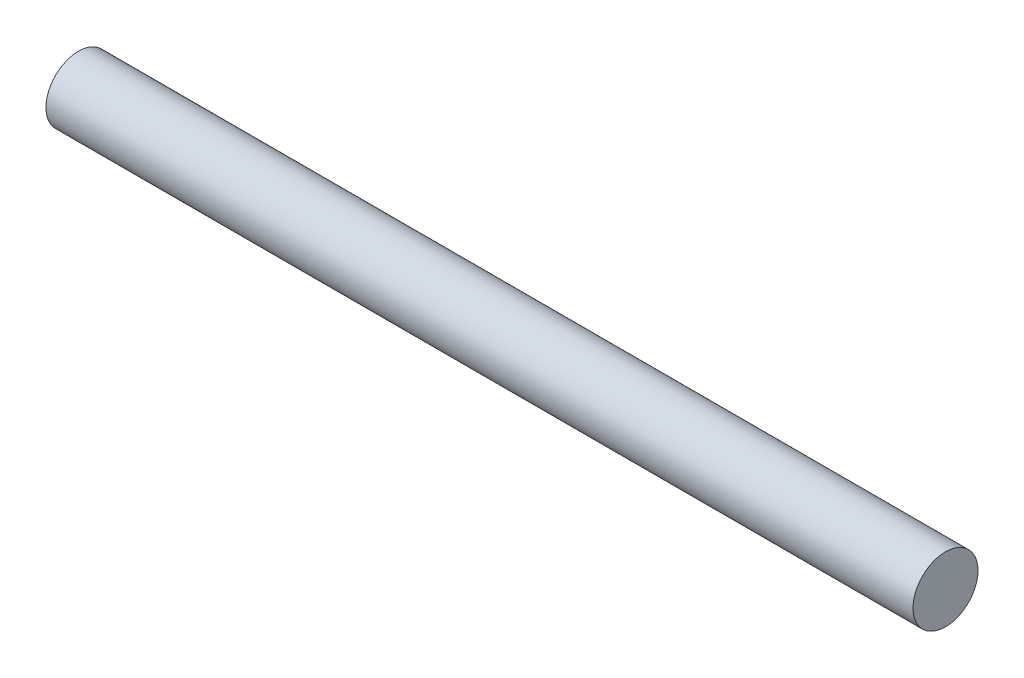
ISO-10303-21;
HEADER;
FILE_DESCRIPTION(('STEP AP214'),'2;1');
FILE_NAME('part.step','',(''),(''),'','','');
FILE_SCHEMA(('AUTOMOTIVE_DESIGN { 1 0 10303 214 1 1 1 1 }'));
ENDSEC;
DATA;
#1=APPLICATION_CONTEXT('core data for automotive mechanical design processes');
#2=APPLICATION_PROTOCOL_DEFINITION('international standard','automotive_design',2000,#1);
#3=PRODUCT_CONTEXT('',#1,'mechanical');
#4=PRODUCT('Part','Part','',(#3));
#5=PRODUCT_RELATED_PRODUCT_CATEGORY('part','',(#4));
#6=PRODUCT_DEFINITION_FORMATION('','',#4);
#7=PRODUCT_DEFINITION_CONTEXT('part definition',#1,'design');
#8=PRODUCT_DEFINITION('design','',#6,#7);
#9=PRODUCT_DEFINITION_SHAPE('','',#8);
#10=(LENGTH_UNIT() NAMED_UNIT(*) SI_UNIT(.MILLI.,.METRE.));
#11=(NAMED_UNIT(*) PLANE_ANGLE_UNIT() SI_UNIT($,.RADIAN.));
#12=(NAMED_UNIT(*) SI_UNIT($,.STERADIAN.) SOLID_ANGLE_UNIT());
#13=UNCERTAINTY_MEASURE_WITH_UNIT(LENGTH_MEASURE(1.E-05),#10,'distance_accuracy_value','');
#14=(GEOMETRIC_REPRESENTATION_CONTEXT(3) GLOBAL_UNCERTAINTY_ASSIGNED_CONTEXT((#13)) GLOBAL_UNIT_ASSIGNED_CONTEXT((#10,
#11,#12)) REPRESENTATION_CONTEXT('',''));
#15=CARTESIAN_POINT('',(0.,0.,0.));
#16=DIRECTION('',(0.,0.,1.));
#17=DIRECTION('',(1.,0.,0.));
#18=AXIS2_PLACEMENT_3D('',#15,#16,#17);
#19=CARTESIAN_POINT('',(127.,0.,0.));
#20=DIRECTION('',(-1.,0.,0.));
#21=DIRECTION('',(0.,0.,1.));
#22=AXIS2_PLACEMENT_3D('',#19,#20,#21);
#23=CYLINDRICAL_SURFACE('',#22,9.525);
#24=CARTESIAN_POINT('',(127.,0.,0.));
#25=DIRECTION('',(1.,0.,0.));
#26=DIRECTION('',(0.,0.,-1.));
#27=AXIS2_PLACEMENT_3D('',#24,#25,#26);
#28=CIRCLE('',#27,9.525);
#29=CARTESIAN_POINT('',(127.,0.,-9.525));
#30=VERTEX_POINT('',#29);
#31=EDGE_CURVE('E10',#30,#30,#28,.T.);
#32=ORIENTED_EDGE('',*,*,#31,.F.);
#33=EDGE_LOOP('',(#32));
#34=FACE_BOUND('',#33,.T.);
#35=CARTESIAN_POINT('',(-127.,0.,0.));
#36=DIRECTION('',(1.,0.,0.));
#37=DIRECTION('',(0.,0.,-1.));
#38=AXIS2_PLACEMENT_3D('',#35,#36,#37);
#39=CIRCLE('',#38,9.525);
#40=CARTESIAN_POINT('',(-127.,0.,-9.525));
#41=VERTEX_POINT('',#40);
#42=EDGE_CURVE('E34',#41,#41,#39,.T.);
#43=ORIENTED_EDGE('',*,*,#42,.T.);
#44=EDGE_LOOP('',(#43));
#45=FACE_BOUND('',#44,.T.);
#46=ADVANCED_FACE('F31',(#34,#45),#23,.T.);
#47=CARTESIAN_POINT('',(127.,0.,0.));
#48=DIRECTION('',(1.,0.,0.));
#49=DIRECTION('',(0.,0.,-1.));
#50=AXIS2_PLACEMENT_3D('',#47,#48,#49);
#51=PLANE('',#50);
#52=ORIENTED_EDGE('',*,*,#31,.T.);
#53=EDGE_LOOP('',(#52));
#54=FACE_BOUND('',#53,.T.);
#55=ADVANCED_FACE('F46',(#54),#51,.T.);
#56=CARTESIAN_POINT('',(-127.,0.,0.));
#57=DIRECTION('',(1.,0.,0.));
#58=DIRECTION('',(0.,0.,-1.));
#59=AXIS2_PLACEMENT_3D('',#56,#57,#58);
#60=PLANE('',#59);
#61=ORIENTED_EDGE('',*,*,#42,.F.);
#62=EDGE_LOOP('',(#61));
#63=FACE_BOUND('',#62,.T.);
#64=ADVANCED_FACE('F44',(#63),#60,.F.);
#65=CLOSED_SHELL('',(#46,#55,#64));
#66=MANIFOLD_SOLID_BREP('B2',#65);
#67=ADVANCED_BREP_SHAPE_REPRESENTATION('',(#18,#66),#14);
#68=SHAPE_DEFINITION_REPRESENTATION(#9,#67);
ENDSEC;
END-ISO-10303-21;
